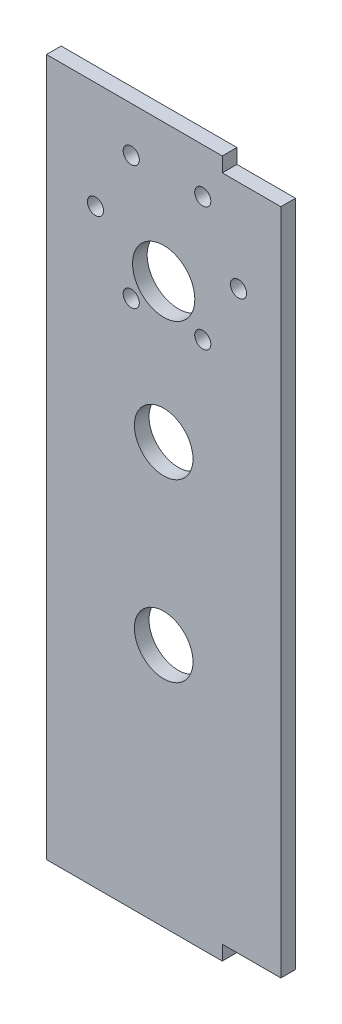
ISO-10303-21;
HEADER;
FILE_DESCRIPTION(('STEP AP214'),'2;1');
FILE_NAME('part.step','',(''),(''),'','','');
FILE_SCHEMA(('AUTOMOTIVE_DESIGN { 1 0 10303 214 1 1 1 1 }'));
ENDSEC;
DATA;
#1=APPLICATION_CONTEXT('core data for automotive mechanical design processes');
#2=APPLICATION_PROTOCOL_DEFINITION('international standard','automotive_design',2000,#1);
#3=PRODUCT_CONTEXT('',#1,'mechanical');
#4=PRODUCT('Part','Part','',(#3));
#5=PRODUCT_RELATED_PRODUCT_CATEGORY('part','',(#4));
#6=PRODUCT_DEFINITION_FORMATION('','',#4);
#7=PRODUCT_DEFINITION_CONTEXT('part definition',#1,'design');
#8=PRODUCT_DEFINITION('design','',#6,#7);
#9=PRODUCT_DEFINITION_SHAPE('','',#8);
#10=(LENGTH_UNIT() NAMED_UNIT(*) SI_UNIT(.MILLI.,.METRE.));
#11=(NAMED_UNIT(*) PLANE_ANGLE_UNIT() SI_UNIT($,.RADIAN.));
#12=(NAMED_UNIT(*) SI_UNIT($,.STERADIAN.) SOLID_ANGLE_UNIT());
#13=UNCERTAINTY_MEASURE_WITH_UNIT(LENGTH_MEASURE(1.E-05),#10,'distance_accuracy_value','');
#14=(GEOMETRIC_REPRESENTATION_CONTEXT(3) GLOBAL_UNCERTAINTY_ASSIGNED_CONTEXT((#13)) GLOBAL_UNIT_ASSIGNED_CONTEXT((#10,
#11,#12)) REPRESENTATION_CONTEXT('',''));
#15=CARTESIAN_POINT('',(0.,0.,0.));
#16=DIRECTION('',(0.,0.,1.));
#17=DIRECTION('',(1.,0.,0.));
#18=AXIS2_PLACEMENT_3D('',#15,#16,#17);
#19=CARTESIAN_POINT('',(0.,0.,3.175));
#20=DIRECTION('',(0.,0.,1.));
#21=DIRECTION('',(1.,0.,0.));
#22=AXIS2_PLACEMENT_3D('',#19,#20,#21);
#23=PLANE('',#22);
#24=CARTESIAN_POINT('',(14.8180703308174,141.378393758659,3.175));
#25=DIRECTION('',(0.,0.,1.));
#26=DIRECTION('',(1.,0.,0.));
#27=AXIS2_PLACEMENT_3D('',#24,#25,#26);
#28=CIRCLE('',#27,1.74999999999982);
#29=CARTESIAN_POINT('',(16.5680703308172,141.378393758659,3.175));
#30=VERTEX_POINT('',#29);
#31=EDGE_CURVE('E220',#30,#30,#28,.T.);
#32=ORIENTED_EDGE('',*,*,#31,.F.);
#33=EDGE_LOOP('',(#32));
#34=FACE_BOUND('',#33,.T.);
#35=CARTESIAN_POINT('',(-8.43192966918257,127.955,3.175));
#36=DIRECTION('',(0.,0.,1.));
#37=DIRECTION('',(1.,0.,0.));
#38=AXIS2_PLACEMENT_3D('',#35,#36,#37);
#39=CIRCLE('',#38,1.75000000000001);
#40=CARTESIAN_POINT('',(-6.68192966918256,127.955,3.175));
#41=VERTEX_POINT('',#40);
#42=EDGE_CURVE('E208',#41,#41,#39,.T.);
#43=ORIENTED_EDGE('',*,*,#42,.F.);
#44=EDGE_LOOP('',(#43));
#45=FACE_BOUND('',#44,.T.);
#46=CARTESIAN_POINT('',(14.8180703308174,114.531606241341,3.175));
#47=DIRECTION('',(0.,0.,1.));
#48=DIRECTION('',(1.,0.,0.));
#49=AXIS2_PLACEMENT_3D('',#46,#47,#48);
#50=CIRCLE('',#49,1.75000000000025);
#51=CARTESIAN_POINT('',(16.5680703308176,114.531606241341,3.175));
#52=VERTEX_POINT('',#51);
#53=EDGE_CURVE('E196',#52,#52,#50,.T.);
#54=ORIENTED_EDGE('',*,*,#53,.F.);
#55=EDGE_LOOP('',(#54));
#56=FACE_BOUND('',#55,.T.);
#57=CARTESIAN_POINT('',(22.5680703308174,127.955,3.175));
#58=DIRECTION('',(0.,0.,1.));
#59=DIRECTION('',(1.,0.,0.));
#60=AXIS2_PLACEMENT_3D('',#57,#58,#59);
#61=CIRCLE('',#60,1.75000000000003);
#62=CARTESIAN_POINT('',(24.3180703308174,127.955,3.175));
#63=VERTEX_POINT('',#62);
#64=EDGE_CURVE('E184',#63,#63,#61,.T.);
#65=ORIENTED_EDGE('',*,*,#64,.F.);
#66=EDGE_LOOP('',(#65));
#67=FACE_BOUND('',#66,.T.);
#68=DIRECTION('',(0.,1.,0.));
#69=VECTOR('',#68,1.);
#70=CARTESIAN_POINT('',(19.0500000000001,147.955,3.175));
#71=LINE('',#70,#69);
#72=CARTESIAN_POINT('',(19.0500000000001,147.955,3.175));
#73=VERTEX_POINT('',#72);
#74=CARTESIAN_POINT('',(19.05,151.13,3.175));
#75=VERTEX_POINT('',#74);
#76=EDGE_CURVE('E147',#73,#75,#71,.T.);
#77=ORIENTED_EDGE('',*,*,#76,.T.);
#78=DIRECTION('',(-1.,0.,0.));
#79=VECTOR('',#78,1.);
#80=CARTESIAN_POINT('',(19.05,151.13,3.175));
#81=LINE('',#80,#79);
#82=CARTESIAN_POINT('',(-19.05,151.13,3.175));
#83=VERTEX_POINT('',#82);
#84=EDGE_CURVE('E95',#75,#83,#81,.T.);
#85=ORIENTED_EDGE('',*,*,#84,.T.);
#86=DIRECTION('',(0.,-1.,0.));
#87=VECTOR('',#86,1.);
#88=CARTESIAN_POINT('',(-19.05,0.,3.175));
#89=LINE('',#88,#87);
#90=CARTESIAN_POINT('',(-19.05,0.,3.175));
#91=VERTEX_POINT('',#90);
#92=EDGE_CURVE('E162',#83,#91,#89,.T.);
#93=ORIENTED_EDGE('',*,*,#92,.T.);
#94=DIRECTION('',(1.,0.,0.));
#95=VECTOR('',#94,1.);
#96=CARTESIAN_POINT('',(19.0500000000001,0.,3.175));
#97=LINE('',#96,#95);
#98=CARTESIAN_POINT('',(19.0500000000001,0.,3.175));
#99=VERTEX_POINT('',#98);
#100=EDGE_CURVE('E175',#91,#99,#97,.T.);
#101=ORIENTED_EDGE('',*,*,#100,.T.);
#102=DIRECTION('',(0.,1.,0.));
#103=VECTOR('',#102,1.);
#104=CARTESIAN_POINT('',(19.0500000000001,0.,3.175));
#105=LINE('',#104,#103);
#106=CARTESIAN_POINT('',(19.0500000000001,3.17499999999998,3.175));
#107=VERTEX_POINT('',#106);
#108=EDGE_CURVE('E114',#99,#107,#105,.T.);
#109=ORIENTED_EDGE('',*,*,#108,.T.);
#110=DIRECTION('',(1.,0.,0.));
#111=VECTOR('',#110,1.);
#112=CARTESIAN_POINT('',(19.0500000000001,3.17499999999998,3.175));
#113=LINE('',#112,#111);
#114=CARTESIAN_POINT('',(31.7500000000001,3.17499999999998,3.175));
#115=VERTEX_POINT('',#114);
#116=EDGE_CURVE('E108',#107,#115,#113,.T.);
#117=ORIENTED_EDGE('',*,*,#116,.T.);
#118=DIRECTION('',(0.,1.,0.));
#119=VECTOR('',#118,1.);
#120=CARTESIAN_POINT('',(31.7500000000001,3.17499999999998,3.175));
#121=LINE('',#120,#119);
#122=CARTESIAN_POINT('',(31.7500000000001,147.955,3.175));
#123=VERTEX_POINT('',#122);
#124=EDGE_CURVE('E112',#115,#123,#121,.T.);
#125=ORIENTED_EDGE('',*,*,#124,.T.);
#126=DIRECTION('',(-1.,0.,0.));
#127=VECTOR('',#126,1.);
#128=CARTESIAN_POINT('',(31.7500000000001,147.955,3.175));
#129=LINE('',#128,#127);
#130=EDGE_CURVE('E52',#123,#73,#129,.T.);
#131=ORIENTED_EDGE('',*,*,#130,.T.);
#132=EDGE_LOOP('',(#77,#85,#93,#101,#109,#117,#125,#131));
#133=FACE_BOUND('',#132,.T.);
#134=CARTESIAN_POINT('',(6.35,121.243303120671,3.175));
#135=DIRECTION('',(0.,0.,1.));
#136=DIRECTION('',(1.,0.,0.));
#137=AXIS2_PLACEMENT_3D('',#134,#135,#136);
#138=CIRCLE('',#137,6.7500000000001);
#139=CARTESIAN_POINT('',(13.1000000000001,121.243303120671,3.175));
#140=VERTEX_POINT('',#139);
#141=EDGE_CURVE('E136',#140,#140,#138,.T.);
#142=ORIENTED_EDGE('',*,*,#141,.F.);
#143=EDGE_LOOP('',(#142));
#144=FACE_BOUND('',#143,.T.);
#145=CARTESIAN_POINT('',(6.34999999999992,91.0808031206706,3.175));
#146=DIRECTION('',(0.,0.,1.));
#147=DIRECTION('',(1.,0.,0.));
#148=AXIS2_PLACEMENT_3D('',#145,#146,#147);
#149=CIRCLE('',#148,6.35);
#150=CARTESIAN_POINT('',(12.6999999999999,91.0808031206706,3.175));
#151=VERTEX_POINT('',#150);
#152=EDGE_CURVE('E190',#151,#151,#149,.T.);
#153=ORIENTED_EDGE('',*,*,#152,.F.);
#154=EDGE_LOOP('',(#153));
#155=FACE_BOUND('',#154,.T.);
#156=CARTESIAN_POINT('',(-0.681929669182572,114.531606241341,3.175));
#157=DIRECTION('',(0.,0.,1.));
#158=DIRECTION('',(1.,0.,0.));
#159=AXIS2_PLACEMENT_3D('',#156,#157,#158);
#160=CIRCLE('',#159,1.75000000000026);
#161=CARTESIAN_POINT('',(1.06807033081768,114.531606241341,3.175));
#162=VERTEX_POINT('',#161);
#163=EDGE_CURVE('E202',#162,#162,#160,.T.);
#164=ORIENTED_EDGE('',*,*,#163,.F.);
#165=EDGE_LOOP('',(#164));
#166=FACE_BOUND('',#165,.T.);
#167=CARTESIAN_POINT('',(-0.681929669182571,141.378393758659,3.175));
#168=DIRECTION('',(0.,0.,1.));
#169=DIRECTION('',(1.,0.,0.));
#170=AXIS2_PLACEMENT_3D('',#167,#168,#169);
#171=CIRCLE('',#170,1.74999999999974);
#172=CARTESIAN_POINT('',(1.06807033081717,141.378393758659,3.175));
#173=VERTEX_POINT('',#172);
#174=EDGE_CURVE('E214',#173,#173,#171,.T.);
#175=ORIENTED_EDGE('',*,*,#174,.F.);
#176=EDGE_LOOP('',(#175));
#177=FACE_BOUND('',#176,.T.);
#178=CARTESIAN_POINT('',(6.34999999999987,52.9808031206706,3.175));
#179=DIRECTION('',(0.,0.,1.));
#180=DIRECTION('',(1.,0.,0.));
#181=AXIS2_PLACEMENT_3D('',#178,#179,#180);
#182=CIRCLE('',#181,6.35);
#183=CARTESIAN_POINT('',(12.6999999999999,52.9808031206706,3.175));
#184=VERTEX_POINT('',#183);
#185=EDGE_CURVE('E226',#184,#184,#182,.T.);
#186=ORIENTED_EDGE('',*,*,#185,.F.);
#187=EDGE_LOOP('',(#186));
#188=FACE_BOUND('',#187,.T.);
#189=ADVANCED_FACE('F35',(#34,#45,#56,#67,#133,#144,#155,#166,#177,#188),#23,.T.);
#190=CARTESIAN_POINT('',(0.,0.,0.));
#191=DIRECTION('',(0.,0.,1.));
#192=DIRECTION('',(1.,0.,0.));
#193=AXIS2_PLACEMENT_3D('',#190,#191,#192);
#194=PLANE('',#193);
#195=DIRECTION('',(0.,1.,0.));
#196=VECTOR('',#195,1.);
#197=CARTESIAN_POINT('',(19.0500000000001,147.955,0.));
#198=LINE('',#197,#196);
#199=CARTESIAN_POINT('',(19.0500000000001,147.955,0.));
#200=VERTEX_POINT('',#199);
#201=CARTESIAN_POINT('',(19.05,151.13,0.));
#202=VERTEX_POINT('',#201);
#203=EDGE_CURVE('E132',#200,#202,#198,.T.);
#204=ORIENTED_EDGE('',*,*,#203,.F.);
#205=DIRECTION('',(-1.,0.,0.));
#206=VECTOR('',#205,1.);
#207=CARTESIAN_POINT('',(31.7500000000001,147.955,0.));
#208=LINE('',#207,#206);
#209=CARTESIAN_POINT('',(31.7500000000001,147.955,0.));
#210=VERTEX_POINT('',#209);
#211=EDGE_CURVE('E87',#210,#200,#208,.T.);
#212=ORIENTED_EDGE('',*,*,#211,.F.);
#213=DIRECTION('',(0.,1.,0.));
#214=VECTOR('',#213,1.);
#215=CARTESIAN_POINT('',(31.7500000000001,3.17499999999998,0.));
#216=LINE('',#215,#214);
#217=CARTESIAN_POINT('',(31.7500000000001,3.17499999999998,0.));
#218=VERTEX_POINT('',#217);
#219=EDGE_CURVE('E81',#218,#210,#216,.T.);
#220=ORIENTED_EDGE('',*,*,#219,.F.);
#221=DIRECTION('',(1.,0.,0.));
#222=VECTOR('',#221,1.);
#223=CARTESIAN_POINT('',(19.0500000000001,3.17499999999998,0.));
#224=LINE('',#223,#222);
#225=CARTESIAN_POINT('',(19.0500000000001,3.17499999999998,0.));
#226=VERTEX_POINT('',#225);
#227=EDGE_CURVE('E122',#226,#218,#224,.T.);
#228=ORIENTED_EDGE('',*,*,#227,.F.);
#229=DIRECTION('',(0.,1.,0.));
#230=VECTOR('',#229,1.);
#231=CARTESIAN_POINT('',(19.0500000000001,0.,0.));
#232=LINE('',#231,#230);
#233=CARTESIAN_POINT('',(19.0500000000001,0.,0.));
#234=VERTEX_POINT('',#233);
#235=EDGE_CURVE('E142',#234,#226,#232,.T.);
#236=ORIENTED_EDGE('',*,*,#235,.F.);
#237=DIRECTION('',(1.,0.,0.));
#238=VECTOR('',#237,1.);
#239=CARTESIAN_POINT('',(19.0500000000001,0.,0.));
#240=LINE('',#239,#238);
#241=CARTESIAN_POINT('',(-19.05,0.,0.));
#242=VERTEX_POINT('',#241);
#243=EDGE_CURVE('E140',#242,#234,#240,.T.);
#244=ORIENTED_EDGE('',*,*,#243,.F.);
#245=DIRECTION('',(0.,-1.,0.));
#246=VECTOR('',#245,1.);
#247=CARTESIAN_POINT('',(-19.05,0.,0.));
#248=LINE('',#247,#246);
#249=CARTESIAN_POINT('',(-19.05,151.13,0.));
#250=VERTEX_POINT('',#249);
#251=EDGE_CURVE('E138',#250,#242,#248,.T.);
#252=ORIENTED_EDGE('',*,*,#251,.F.);
#253=DIRECTION('',(-1.,0.,0.));
#254=VECTOR('',#253,1.);
#255=CARTESIAN_POINT('',(19.05,151.13,0.));
#256=LINE('',#255,#254);
#257=EDGE_CURVE('E135',#202,#250,#256,.T.);
#258=ORIENTED_EDGE('',*,*,#257,.F.);
#259=EDGE_LOOP('',(#204,#212,#220,#228,#236,#244,#252,#258));
#260=FACE_BOUND('',#259,.T.);
#261=CARTESIAN_POINT('',(6.35,121.243303120671,0.));
#262=DIRECTION('',(0.,0.,1.));
#263=DIRECTION('',(1.,0.,0.));
#264=AXIS2_PLACEMENT_3D('',#261,#262,#263);
#265=CIRCLE('',#264,6.7500000000001);
#266=CARTESIAN_POINT('',(13.1000000000001,121.243303120671,0.));
#267=VERTEX_POINT('',#266);
#268=EDGE_CURVE('E181',#267,#267,#265,.T.);
#269=ORIENTED_EDGE('',*,*,#268,.T.);
#270=EDGE_LOOP('',(#269));
#271=FACE_BOUND('',#270,.T.);
#272=CARTESIAN_POINT('',(22.5680703308174,127.955,0.));
#273=DIRECTION('',(0.,0.,1.));
#274=DIRECTION('',(1.,0.,0.));
#275=AXIS2_PLACEMENT_3D('',#272,#273,#274);
#276=CIRCLE('',#275,1.75000000000003);
#277=CARTESIAN_POINT('',(24.3180703308174,127.955,0.));
#278=VERTEX_POINT('',#277);
#279=EDGE_CURVE('E187',#278,#278,#276,.T.);
#280=ORIENTED_EDGE('',*,*,#279,.T.);
#281=EDGE_LOOP('',(#280));
#282=FACE_BOUND('',#281,.T.);
#283=CARTESIAN_POINT('',(6.34999999999992,91.0808031206706,0.));
#284=DIRECTION('',(0.,0.,1.));
#285=DIRECTION('',(1.,0.,0.));
#286=AXIS2_PLACEMENT_3D('',#283,#284,#285);
#287=CIRCLE('',#286,6.35);
#288=CARTESIAN_POINT('',(12.6999999999999,91.0808031206706,0.));
#289=VERTEX_POINT('',#288);
#290=EDGE_CURVE('E193',#289,#289,#287,.T.);
#291=ORIENTED_EDGE('',*,*,#290,.T.);
#292=EDGE_LOOP('',(#291));
#293=FACE_BOUND('',#292,.T.);
#294=CARTESIAN_POINT('',(14.8180703308174,114.531606241341,0.));
#295=DIRECTION('',(0.,0.,1.));
#296=DIRECTION('',(1.,0.,0.));
#297=AXIS2_PLACEMENT_3D('',#294,#295,#296);
#298=CIRCLE('',#297,1.75000000000025);
#299=CARTESIAN_POINT('',(16.5680703308176,114.531606241341,0.));
#300=VERTEX_POINT('',#299);
#301=EDGE_CURVE('E199',#300,#300,#298,.T.);
#302=ORIENTED_EDGE('',*,*,#301,.T.);
#303=EDGE_LOOP('',(#302));
#304=FACE_BOUND('',#303,.T.);
#305=CARTESIAN_POINT('',(-0.681929669182572,114.531606241341,0.));
#306=DIRECTION('',(0.,0.,1.));
#307=DIRECTION('',(1.,0.,0.));
#308=AXIS2_PLACEMENT_3D('',#305,#306,#307);
#309=CIRCLE('',#308,1.75000000000026);
#310=CARTESIAN_POINT('',(1.06807033081768,114.531606241341,0.));
#311=VERTEX_POINT('',#310);
#312=EDGE_CURVE('E205',#311,#311,#309,.T.);
#313=ORIENTED_EDGE('',*,*,#312,.T.);
#314=EDGE_LOOP('',(#313));
#315=FACE_BOUND('',#314,.T.);
#316=CARTESIAN_POINT('',(-8.43192966918257,127.955,0.));
#317=DIRECTION('',(0.,0.,1.));
#318=DIRECTION('',(1.,0.,0.));
#319=AXIS2_PLACEMENT_3D('',#316,#317,#318);
#320=CIRCLE('',#319,1.75000000000001);
#321=CARTESIAN_POINT('',(-6.68192966918256,127.955,0.));
#322=VERTEX_POINT('',#321);
#323=EDGE_CURVE('E211',#322,#322,#320,.T.);
#324=ORIENTED_EDGE('',*,*,#323,.T.);
#325=EDGE_LOOP('',(#324));
#326=FACE_BOUND('',#325,.T.);
#327=CARTESIAN_POINT('',(-0.681929669182571,141.378393758659,0.));
#328=DIRECTION('',(0.,0.,1.));
#329=DIRECTION('',(1.,0.,0.));
#330=AXIS2_PLACEMENT_3D('',#327,#328,#329);
#331=CIRCLE('',#330,1.74999999999974);
#332=CARTESIAN_POINT('',(1.06807033081717,141.378393758659,0.));
#333=VERTEX_POINT('',#332);
#334=EDGE_CURVE('E217',#333,#333,#331,.T.);
#335=ORIENTED_EDGE('',*,*,#334,.T.);
#336=EDGE_LOOP('',(#335));
#337=FACE_BOUND('',#336,.T.);
#338=CARTESIAN_POINT('',(14.8180703308174,141.378393758659,0.));
#339=DIRECTION('',(0.,0.,1.));
#340=DIRECTION('',(1.,0.,0.));
#341=AXIS2_PLACEMENT_3D('',#338,#339,#340);
#342=CIRCLE('',#341,1.74999999999982);
#343=CARTESIAN_POINT('',(16.5680703308172,141.378393758659,0.));
#344=VERTEX_POINT('',#343);
#345=EDGE_CURVE('E223',#344,#344,#342,.T.);
#346=ORIENTED_EDGE('',*,*,#345,.T.);
#347=EDGE_LOOP('',(#346));
#348=FACE_BOUND('',#347,.T.);
#349=CARTESIAN_POINT('',(6.34999999999987,52.9808031206706,0.));
#350=DIRECTION('',(0.,0.,1.));
#351=DIRECTION('',(1.,0.,0.));
#352=AXIS2_PLACEMENT_3D('',#349,#350,#351);
#353=CIRCLE('',#352,6.35);
#354=CARTESIAN_POINT('',(12.6999999999999,52.9808031206706,0.));
#355=VERTEX_POINT('',#354);
#356=EDGE_CURVE('E229',#355,#355,#353,.T.);
#357=ORIENTED_EDGE('',*,*,#356,.T.);
#358=EDGE_LOOP('',(#357));
#359=FACE_BOUND('',#358,.T.);
#360=ADVANCED_FACE('F166',(#260,#271,#282,#293,#304,#315,#326,#337,#348,#359),#194,.F.);
#361=CARTESIAN_POINT('',(19.0500000000001,147.955,3.175));
#362=DIRECTION('',(-1.,0.,0.));
#363=DIRECTION('',(0.,-1.,0.));
#364=AXIS2_PLACEMENT_3D('',#361,#362,#363);
#365=PLANE('',#364);
#366=ORIENTED_EDGE('',*,*,#203,.T.);
#367=DIRECTION('',(0.,0.,-1.));
#368=VECTOR('',#367,1.);
#369=CARTESIAN_POINT('',(19.05,151.13,3.175));
#370=LINE('',#369,#368);
#371=EDGE_CURVE('E11',#75,#202,#370,.T.);
#372=ORIENTED_EDGE('',*,*,#371,.F.);
#373=ORIENTED_EDGE('',*,*,#76,.F.);
#374=DIRECTION('',(0.,0.,-1.));
#375=VECTOR('',#374,1.);
#376=CARTESIAN_POINT('',(19.0500000000001,147.955,3.175));
#377=LINE('',#376,#375);
#378=EDGE_CURVE('E128',#73,#200,#377,.T.);
#379=ORIENTED_EDGE('',*,*,#378,.T.);
#380=EDGE_LOOP('',(#366,#372,#373,#379));
#381=FACE_BOUND('',#380,.T.);
#382=ADVANCED_FACE('F37',(#381),#365,.F.);
#383=CARTESIAN_POINT('',(19.05,151.13,3.175));
#384=DIRECTION('',(0.,-1.,0.));
#385=DIRECTION('',(0.,0.,-1.));
#386=AXIS2_PLACEMENT_3D('',#383,#384,#385);
#387=PLANE('',#386);
#388=ORIENTED_EDGE('',*,*,#257,.T.);
#389=DIRECTION('',(0.,0.,-1.));
#390=VECTOR('',#389,1.);
#391=CARTESIAN_POINT('',(-19.05,151.13,3.175));
#392=LINE('',#391,#390);
#393=EDGE_CURVE('E44',#83,#250,#392,.T.);
#394=ORIENTED_EDGE('',*,*,#393,.F.);
#395=ORIENTED_EDGE('',*,*,#84,.F.);
#396=ORIENTED_EDGE('',*,*,#371,.T.);
#397=EDGE_LOOP('',(#388,#394,#395,#396));
#398=FACE_BOUND('',#397,.T.);
#399=ADVANCED_FACE('F263',(#398),#387,.F.);
#400=CARTESIAN_POINT('',(-19.05,0.,3.175));
#401=DIRECTION('',(1.,0.,0.));
#402=DIRECTION('',(0.,1.,0.));
#403=AXIS2_PLACEMENT_3D('',#400,#401,#402);
#404=PLANE('',#403);
#405=ORIENTED_EDGE('',*,*,#251,.T.);
#406=DIRECTION('',(0.,0.,-1.));
#407=VECTOR('',#406,1.);
#408=CARTESIAN_POINT('',(-19.05,0.,3.175));
#409=LINE('',#408,#407);
#410=EDGE_CURVE('E154',#91,#242,#409,.T.);
#411=ORIENTED_EDGE('',*,*,#410,.F.);
#412=ORIENTED_EDGE('',*,*,#92,.F.);
#413=ORIENTED_EDGE('',*,*,#393,.T.);
#414=EDGE_LOOP('',(#405,#411,#412,#413));
#415=FACE_BOUND('',#414,.T.);
#416=ADVANCED_FACE('F160',(#415),#404,.F.);
#417=CARTESIAN_POINT('',(19.0500000000001,0.,3.175));
#418=DIRECTION('',(0.,1.,0.));
#419=DIRECTION('',(-1.,0.,0.));
#420=AXIS2_PLACEMENT_3D('',#417,#418,#419);
#421=PLANE('',#420);
#422=ORIENTED_EDGE('',*,*,#243,.T.);
#423=DIRECTION('',(0.,0.,-1.));
#424=VECTOR('',#423,1.);
#425=CARTESIAN_POINT('',(19.0500000000001,0.,3.175));
#426=LINE('',#425,#424);
#427=EDGE_CURVE('E151',#99,#234,#426,.T.);
#428=ORIENTED_EDGE('',*,*,#427,.F.);
#429=ORIENTED_EDGE('',*,*,#100,.F.);
#430=ORIENTED_EDGE('',*,*,#410,.T.);
#431=EDGE_LOOP('',(#422,#428,#429,#430));
#432=FACE_BOUND('',#431,.T.);
#433=ADVANCED_FACE('F171',(#432),#421,.F.);
#434=CARTESIAN_POINT('',(19.0500000000001,0.,3.175));
#435=DIRECTION('',(-1.,0.,0.));
#436=DIRECTION('',(0.,0.,1.));
#437=AXIS2_PLACEMENT_3D('',#434,#435,#436);
#438=PLANE('',#437);
#439=ORIENTED_EDGE('',*,*,#235,.T.);
#440=DIRECTION('',(0.,0.,-1.));
#441=VECTOR('',#440,1.);
#442=CARTESIAN_POINT('',(19.0500000000001,3.17499999999998,3.175));
#443=LINE('',#442,#441);
#444=EDGE_CURVE('E123',#107,#226,#443,.T.);
#445=ORIENTED_EDGE('',*,*,#444,.F.);
#446=ORIENTED_EDGE('',*,*,#108,.F.);
#447=ORIENTED_EDGE('',*,*,#427,.T.);
#448=EDGE_LOOP('',(#439,#445,#446,#447));
#449=FACE_BOUND('',#448,.T.);
#450=ADVANCED_FACE('F174',(#449),#438,.F.);
#451=CARTESIAN_POINT('',(19.0500000000001,3.17499999999998,3.175));
#452=DIRECTION('',(0.,1.,0.));
#453=DIRECTION('',(-1.,0.,0.));
#454=AXIS2_PLACEMENT_3D('',#451,#452,#453);
#455=PLANE('',#454);
#456=ORIENTED_EDGE('',*,*,#227,.T.);
#457=DIRECTION('',(0.,0.,-1.));
#458=VECTOR('',#457,1.);
#459=CARTESIAN_POINT('',(31.7500000000001,3.17499999999998,3.175));
#460=LINE('',#459,#458);
#461=EDGE_CURVE('E119',#115,#218,#460,.T.);
#462=ORIENTED_EDGE('',*,*,#461,.F.);
#463=ORIENTED_EDGE('',*,*,#116,.F.);
#464=ORIENTED_EDGE('',*,*,#444,.T.);
#465=EDGE_LOOP('',(#456,#462,#463,#464));
#466=FACE_BOUND('',#465,.T.);
#467=ADVANCED_FACE('F120',(#466),#455,.F.);
#468=CARTESIAN_POINT('',(31.7500000000001,3.17499999999998,3.175));
#469=DIRECTION('',(-1.,0.,0.));
#470=DIRECTION('',(0.,0.,1.));
#471=AXIS2_PLACEMENT_3D('',#468,#469,#470);
#472=PLANE('',#471);
#473=ORIENTED_EDGE('',*,*,#219,.T.);
#474=DIRECTION('',(0.,0.,-1.));
#475=VECTOR('',#474,1.);
#476=CARTESIAN_POINT('',(31.7500000000001,147.955,3.175));
#477=LINE('',#476,#475);
#478=EDGE_CURVE('E124',#123,#210,#477,.T.);
#479=ORIENTED_EDGE('',*,*,#478,.F.);
#480=ORIENTED_EDGE('',*,*,#124,.F.);
#481=ORIENTED_EDGE('',*,*,#461,.T.);
#482=EDGE_LOOP('',(#473,#479,#480,#481));
#483=FACE_BOUND('',#482,.T.);
#484=ADVANCED_FACE('F126',(#483),#472,.F.);
#485=CARTESIAN_POINT('',(31.7500000000001,147.955,3.175));
#486=DIRECTION('',(0.,-1.,0.));
#487=DIRECTION('',(0.,0.,-1.));
#488=AXIS2_PLACEMENT_3D('',#485,#486,#487);
#489=PLANE('',#488);
#490=ORIENTED_EDGE('',*,*,#211,.T.);
#491=ORIENTED_EDGE('',*,*,#378,.F.);
#492=ORIENTED_EDGE('',*,*,#130,.F.);
#493=ORIENTED_EDGE('',*,*,#478,.T.);
#494=EDGE_LOOP('',(#490,#491,#492,#493));
#495=FACE_BOUND('',#494,.T.);
#496=ADVANCED_FACE('F251',(#495),#489,.F.);
#497=CARTESIAN_POINT('',(6.35,121.243303120671,3.175));
#498=DIRECTION('',(0.,0.,-1.));
#499=DIRECTION('',(-1.,0.,0.));
#500=AXIS2_PLACEMENT_3D('',#497,#498,#499);
#501=CYLINDRICAL_SURFACE('',#500,6.7500000000001);
#502=ORIENTED_EDGE('',*,*,#141,.T.);
#503=EDGE_LOOP('',(#502));
#504=FACE_BOUND('',#503,.T.);
#505=ORIENTED_EDGE('',*,*,#268,.F.);
#506=EDGE_LOOP('',(#505));
#507=FACE_BOUND('',#506,.T.);
#508=ADVANCED_FACE('F248',(#504,#507),#501,.F.);
#509=CARTESIAN_POINT('',(22.5680703308174,127.955,3.175));
#510=DIRECTION('',(0.,0.,-1.));
#511=DIRECTION('',(-1.,0.,0.));
#512=AXIS2_PLACEMENT_3D('',#509,#510,#511);
#513=CYLINDRICAL_SURFACE('',#512,1.75000000000003);
#514=ORIENTED_EDGE('',*,*,#64,.T.);
#515=EDGE_LOOP('',(#514));
#516=FACE_BOUND('',#515,.T.);
#517=ORIENTED_EDGE('',*,*,#279,.F.);
#518=EDGE_LOOP('',(#517));
#519=FACE_BOUND('',#518,.T.);
#520=ADVANCED_FACE('F327',(#516,#519),#513,.F.);
#521=CARTESIAN_POINT('',(6.34999999999992,91.0808031206706,3.175));
#522=DIRECTION('',(0.,0.,-1.));
#523=DIRECTION('',(-1.,0.,0.));
#524=AXIS2_PLACEMENT_3D('',#521,#522,#523);
#525=CYLINDRICAL_SURFACE('',#524,6.35);
#526=ORIENTED_EDGE('',*,*,#152,.T.);
#527=EDGE_LOOP('',(#526));
#528=FACE_BOUND('',#527,.T.);
#529=ORIENTED_EDGE('',*,*,#290,.F.);
#530=EDGE_LOOP('',(#529));
#531=FACE_BOUND('',#530,.T.);
#532=ADVANCED_FACE('F335',(#528,#531),#525,.F.);
#533=CARTESIAN_POINT('',(14.8180703308174,114.531606241341,3.175));
#534=DIRECTION('',(0.,0.,-1.));
#535=DIRECTION('',(-1.,0.,0.));
#536=AXIS2_PLACEMENT_3D('',#533,#534,#535);
#537=CYLINDRICAL_SURFACE('',#536,1.75000000000025);
#538=ORIENTED_EDGE('',*,*,#53,.T.);
#539=EDGE_LOOP('',(#538));
#540=FACE_BOUND('',#539,.T.);
#541=ORIENTED_EDGE('',*,*,#301,.F.);
#542=EDGE_LOOP('',(#541));
#543=FACE_BOUND('',#542,.T.);
#544=ADVANCED_FACE('F343',(#540,#543),#537,.F.);
#545=CARTESIAN_POINT('',(-0.681929669182572,114.531606241341,3.175));
#546=DIRECTION('',(0.,0.,-1.));
#547=DIRECTION('',(-1.,0.,0.));
#548=AXIS2_PLACEMENT_3D('',#545,#546,#547);
#549=CYLINDRICAL_SURFACE('',#548,1.75000000000026);
#550=ORIENTED_EDGE('',*,*,#163,.T.);
#551=EDGE_LOOP('',(#550));
#552=FACE_BOUND('',#551,.T.);
#553=ORIENTED_EDGE('',*,*,#312,.F.);
#554=EDGE_LOOP('',(#553));
#555=FACE_BOUND('',#554,.T.);
#556=ADVANCED_FACE('F352',(#552,#555),#549,.F.);
#557=CARTESIAN_POINT('',(-8.43192966918257,127.955,3.175));
#558=DIRECTION('',(0.,0.,-1.));
#559=DIRECTION('',(-1.,0.,0.));
#560=AXIS2_PLACEMENT_3D('',#557,#558,#559);
#561=CYLINDRICAL_SURFACE('',#560,1.75000000000001);
#562=ORIENTED_EDGE('',*,*,#42,.T.);
#563=EDGE_LOOP('',(#562));
#564=FACE_BOUND('',#563,.T.);
#565=ORIENTED_EDGE('',*,*,#323,.F.);
#566=EDGE_LOOP('',(#565));
#567=FACE_BOUND('',#566,.T.);
#568=ADVANCED_FACE('F361',(#564,#567),#561,.F.);
#569=CARTESIAN_POINT('',(-0.681929669182571,141.378393758659,3.175));
#570=DIRECTION('',(0.,0.,-1.));
#571=DIRECTION('',(-1.,0.,0.));
#572=AXIS2_PLACEMENT_3D('',#569,#570,#571);
#573=CYLINDRICAL_SURFACE('',#572,1.74999999999974);
#574=ORIENTED_EDGE('',*,*,#174,.T.);
#575=EDGE_LOOP('',(#574));
#576=FACE_BOUND('',#575,.T.);
#577=ORIENTED_EDGE('',*,*,#334,.F.);
#578=EDGE_LOOP('',(#577));
#579=FACE_BOUND('',#578,.T.);
#580=ADVANCED_FACE('F370',(#576,#579),#573,.F.);
#581=CARTESIAN_POINT('',(14.8180703308174,141.378393758659,3.175));
#582=DIRECTION('',(0.,0.,-1.));
#583=DIRECTION('',(-1.,0.,0.));
#584=AXIS2_PLACEMENT_3D('',#581,#582,#583);
#585=CYLINDRICAL_SURFACE('',#584,1.74999999999982);
#586=ORIENTED_EDGE('',*,*,#31,.T.);
#587=EDGE_LOOP('',(#586));
#588=FACE_BOUND('',#587,.T.);
#589=ORIENTED_EDGE('',*,*,#345,.F.);
#590=EDGE_LOOP('',(#589));
#591=FACE_BOUND('',#590,.T.);
#592=ADVANCED_FACE('F379',(#588,#591),#585,.F.);
#593=CARTESIAN_POINT('',(6.34999999999987,52.9808031206706,3.175));
#594=DIRECTION('',(0.,0.,-1.));
#595=DIRECTION('',(-1.,0.,0.));
#596=AXIS2_PLACEMENT_3D('',#593,#594,#595);
#597=CYLINDRICAL_SURFACE('',#596,6.35);
#598=ORIENTED_EDGE('',*,*,#185,.T.);
#599=EDGE_LOOP('',(#598));
#600=FACE_BOUND('',#599,.T.);
#601=ORIENTED_EDGE('',*,*,#356,.F.);
#602=EDGE_LOOP('',(#601));
#603=FACE_BOUND('',#602,.T.);
#604=ADVANCED_FACE('F235',(#600,#603),#597,.F.);
#605=CLOSED_SHELL('',(#189,#360,#382,#399,#416,#433,#450,#467,#484,#496,#508,#520,#532,#544,
#556,#568,#580,#592,#604));
#606=MANIFOLD_SOLID_BREP('B2',#605);
#607=ADVANCED_BREP_SHAPE_REPRESENTATION('',(#18,#606),#14);
#608=SHAPE_DEFINITION_REPRESENTATION(#9,#607);
ENDSEC;
END-ISO-10303-21;
